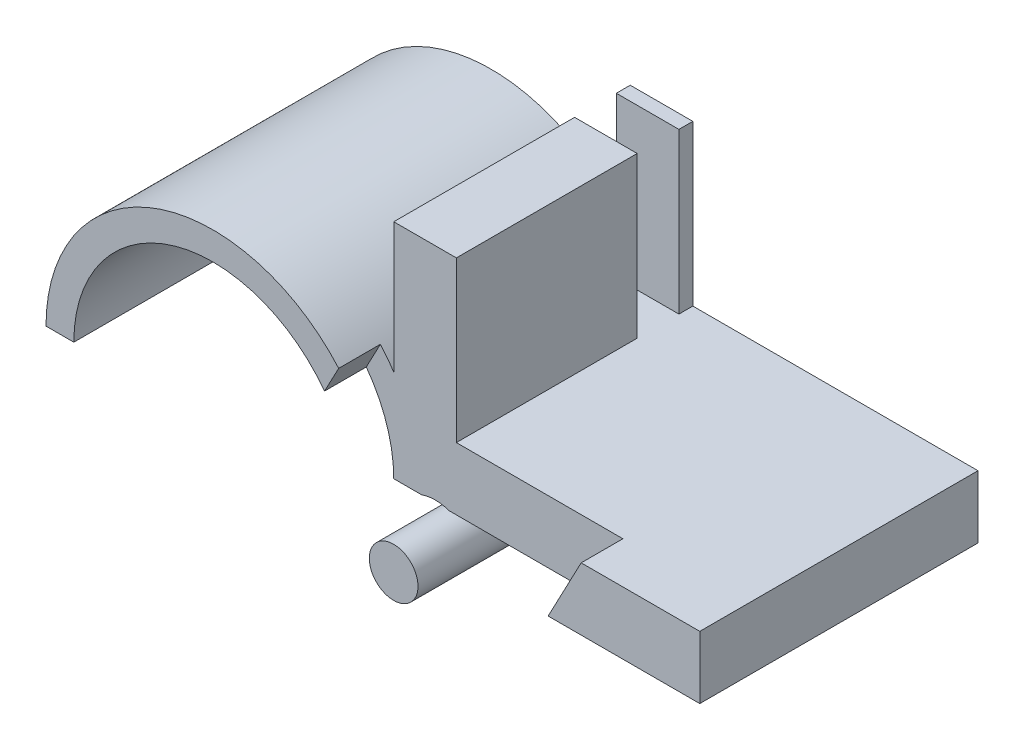
ISO-10303-21;
HEADER;
FILE_DESCRIPTION(('STEP AP214'),'2;1');
FILE_NAME('part.step','',(''),(''),'','','');
FILE_SCHEMA(('AUTOMOTIVE_DESIGN { 1 0 10303 214 1 1 1 1 }'));
ENDSEC;
DATA;
#1=APPLICATION_CONTEXT('core data for automotive mechanical design processes');
#2=APPLICATION_PROTOCOL_DEFINITION('international standard','automotive_design',2000,#1);
#3=PRODUCT_CONTEXT('',#1,'mechanical');
#4=PRODUCT('Part','Part','',(#3));
#5=PRODUCT_RELATED_PRODUCT_CATEGORY('part','',(#4));
#6=PRODUCT_DEFINITION_FORMATION('','',#4);
#7=PRODUCT_DEFINITION_CONTEXT('part definition',#1,'design');
#8=PRODUCT_DEFINITION('design','',#6,#7);
#9=PRODUCT_DEFINITION_SHAPE('','',#8);
#10=(LENGTH_UNIT() NAMED_UNIT(*) SI_UNIT(.MILLI.,.METRE.));
#11=(NAMED_UNIT(*) PLANE_ANGLE_UNIT() SI_UNIT($,.RADIAN.));
#12=(NAMED_UNIT(*) SI_UNIT($,.STERADIAN.) SOLID_ANGLE_UNIT());
#13=UNCERTAINTY_MEASURE_WITH_UNIT(LENGTH_MEASURE(1.E-05),#10,'distance_accuracy_value','');
#14=(GEOMETRIC_REPRESENTATION_CONTEXT(3) GLOBAL_UNCERTAINTY_ASSIGNED_CONTEXT((#13)) GLOBAL_UNIT_ASSIGNED_CONTEXT((#10,
#11,#12)) REPRESENTATION_CONTEXT('',''));
#15=CARTESIAN_POINT('',(0.,0.,0.));
#16=DIRECTION('',(0.,0.,1.));
#17=DIRECTION('',(1.,0.,0.));
#18=AXIS2_PLACEMENT_3D('',#15,#16,#17);
#19=CARTESIAN_POINT('',(10.,16.,20.));
#20=DIRECTION('',(-1.,0.,0.));
#21=DIRECTION('',(0.,0.,1.));
#22=AXIS2_PLACEMENT_3D('',#19,#20,#21);
#23=PLANE('',#22);
#24=DIRECTION('',(0.,1.,0.));
#25=VECTOR('',#24,1.);
#26=CARTESIAN_POINT('',(10.,16.,4.));
#27=LINE('',#26,#25);
#28=CARTESIAN_POINT('',(10.,6.63324958071081,4.));
#29=VERTEX_POINT('',#28);
#30=CARTESIAN_POINT('',(10.,16.,4.));
#31=VERTEX_POINT('',#30);
#32=EDGE_CURVE('E257',#29,#31,#27,.T.);
#33=ORIENTED_EDGE('',*,*,#32,.F.);
#34=DIRECTION('',(0.,0.,-1.));
#35=VECTOR('',#34,1.);
#36=CARTESIAN_POINT('',(10.,6.63324958071081,20.));
#37=LINE('',#36,#35);
#38=CARTESIAN_POINT('',(10.,6.63324958071081,17.));
#39=VERTEX_POINT('',#38);
#40=EDGE_CURVE('E320',#29,#39,#37,.F.);
#41=ORIENTED_EDGE('',*,*,#40,.T.);
#42=DIRECTION('',(0.,1.,0.));
#43=VECTOR('',#42,1.);
#44=CARTESIAN_POINT('',(10.,16.,17.));
#45=LINE('',#44,#43);
#46=CARTESIAN_POINT('',(10.,16.,17.));
#47=VERTEX_POINT('',#46);
#48=EDGE_CURVE('E286',#39,#47,#45,.T.);
#49=ORIENTED_EDGE('',*,*,#48,.T.);
#50=DIRECTION('',(0.,0.,-1.));
#51=VECTOR('',#50,1.);
#52=CARTESIAN_POINT('',(10.,16.,20.));
#53=LINE('',#52,#51);
#54=EDGE_CURVE('E306',#47,#31,#53,.T.);
#55=ORIENTED_EDGE('',*,*,#54,.T.);
#56=EDGE_LOOP('',(#33,#41,#49,#55));
#57=FACE_BOUND('',#56,.T.);
#58=ADVANCED_FACE('F65',(#57),#23,.T.);
#59=CARTESIAN_POINT('',(0.,16.,0.));
#60=DIRECTION('',(0.,-1.,0.));
#61=DIRECTION('',(0.,0.,-1.));
#62=AXIS2_PLACEMENT_3D('',#59,#60,#61);
#63=PLANE('',#62);
#64=DIRECTION('',(0.,0.,1.));
#65=VECTOR('',#64,1.);
#66=CARTESIAN_POINT('',(14.5,16.,20.));
#67=LINE('',#66,#65);
#68=CARTESIAN_POINT('',(14.5,16.,4.));
#69=VERTEX_POINT('',#68);
#70=CARTESIAN_POINT('',(14.5,16.,17.));
#71=VERTEX_POINT('',#70);
#72=EDGE_CURVE('E312',#69,#71,#67,.T.);
#73=ORIENTED_EDGE('',*,*,#72,.F.);
#74=DIRECTION('',(1.,0.,0.));
#75=VECTOR('',#74,1.);
#76=CARTESIAN_POINT('',(9.5,16.,4.));
#77=LINE('',#76,#75);
#78=EDGE_CURVE('E245',#31,#69,#77,.T.);
#79=ORIENTED_EDGE('',*,*,#78,.F.);
#80=ORIENTED_EDGE('',*,*,#54,.F.);
#81=DIRECTION('',(-1.,0.,0.));
#82=VECTOR('',#81,1.);
#83=CARTESIAN_POINT('',(0.,16.,17.));
#84=LINE('',#83,#82);
#85=EDGE_CURVE('E396',#71,#47,#84,.T.);
#86=ORIENTED_EDGE('',*,*,#85,.F.);
#87=EDGE_LOOP('',(#73,#79,#80,#86));
#88=FACE_BOUND('',#87,.T.);
#89=ADVANCED_FACE('F425',(#88),#63,.F.);
#90=CARTESIAN_POINT('',(14.5,16.,20.));
#91=DIRECTION('',(1.,0.,0.));
#92=DIRECTION('',(0.,0.,-1.));
#93=AXIS2_PLACEMENT_3D('',#90,#91,#92);
#94=PLANE('',#93);
#95=DIRECTION('',(0.,-1.,0.));
#96=VECTOR('',#95,1.);
#97=CARTESIAN_POINT('',(14.5,16.,4.));
#98=LINE('',#97,#96);
#99=CARTESIAN_POINT('',(14.5,4.5,4.));
#100=VERTEX_POINT('',#99);
#101=EDGE_CURVE('E80',#69,#100,#98,.T.);
#102=ORIENTED_EDGE('',*,*,#101,.F.);
#103=ORIENTED_EDGE('',*,*,#72,.T.);
#104=DIRECTION('',(0.,-1.,0.));
#105=VECTOR('',#104,1.);
#106=CARTESIAN_POINT('',(14.5,16.,17.));
#107=LINE('',#106,#105);
#108=CARTESIAN_POINT('',(14.5,4.5,17.));
#109=VERTEX_POINT('',#108);
#110=EDGE_CURVE('E273',#71,#109,#107,.T.);
#111=ORIENTED_EDGE('',*,*,#110,.T.);
#112=DIRECTION('',(0.,0.,1.));
#113=VECTOR('',#112,1.);
#114=CARTESIAN_POINT('',(14.5,4.5,0.));
#115=LINE('',#114,#113);
#116=EDGE_CURVE('E393',#100,#109,#115,.T.);
#117=ORIENTED_EDGE('',*,*,#116,.F.);
#118=EDGE_LOOP('',(#102,#103,#111,#117));
#119=FACE_BOUND('',#118,.T.);
#120=ADVANCED_FACE('F487',(#119),#94,.T.);
#121=DIRECTION('',(0.,-1.,0.));
#122=VECTOR('',#121,1.);
#123=CARTESIAN_POINT('',(10.,16.,1.));
#124=LINE('',#123,#122);
#125=CARTESIAN_POINT('',(10.,16.,1.));
#126=VERTEX_POINT('',#125);
#127=CARTESIAN_POINT('',(10.,6.63324958071081,1.));
#128=VERTEX_POINT('',#127);
#129=EDGE_CURVE('E253',#126,#128,#124,.T.);
#130=ORIENTED_EDGE('',*,*,#129,.F.);
#131=CARTESIAN_POINT('',(10.,16.,0.));
#132=VERTEX_POINT('',#131);
#133=EDGE_CURVE('E305',#126,#132,#53,.T.);
#134=ORIENTED_EDGE('',*,*,#133,.T.);
#135=DIRECTION('',(0.,-1.,0.));
#136=VECTOR('',#135,1.);
#137=CARTESIAN_POINT('',(10.,16.,0.));
#138=LINE('',#137,#136);
#139=CARTESIAN_POINT('',(10.,6.63324958071081,0.));
#140=VERTEX_POINT('',#139);
#141=EDGE_CURVE('E316',#132,#140,#138,.T.);
#142=ORIENTED_EDGE('',*,*,#141,.T.);
#143=EDGE_CURVE('E323',#140,#128,#37,.F.);
#144=ORIENTED_EDGE('',*,*,#143,.T.);
#145=EDGE_LOOP('',(#130,#134,#142,#144));
#146=FACE_BOUND('',#145,.T.);
#147=ADVANCED_FACE('F482',(#146),#23,.T.);
#148=ORIENTED_EDGE('',*,*,#133,.F.);
#149=DIRECTION('',(1.,0.,0.));
#150=VECTOR('',#149,1.);
#151=CARTESIAN_POINT('',(9.5,16.,1.));
#152=LINE('',#151,#150);
#153=CARTESIAN_POINT('',(14.5,16.,1.));
#154=VERTEX_POINT('',#153);
#155=EDGE_CURVE('E248',#126,#154,#152,.T.);
#156=ORIENTED_EDGE('',*,*,#155,.T.);
#157=CARTESIAN_POINT('',(14.5,16.,0.));
#158=VERTEX_POINT('',#157);
#159=EDGE_CURVE('E313',#158,#154,#67,.T.);
#160=ORIENTED_EDGE('',*,*,#159,.F.);
#161=DIRECTION('',(1.,0.,0.));
#162=VECTOR('',#161,1.);
#163=CARTESIAN_POINT('',(10.,16.,0.));
#164=LINE('',#163,#162);
#165=EDGE_CURVE('E309',#132,#158,#164,.T.);
#166=ORIENTED_EDGE('',*,*,#165,.F.);
#167=EDGE_LOOP('',(#148,#156,#160,#166));
#168=FACE_BOUND('',#167,.T.);
#169=ADVANCED_FACE('F489',(#168),#63,.F.);
#170=CARTESIAN_POINT('',(0.,0.,20.));
#171=DIRECTION('',(0.,-1.,0.));
#172=DIRECTION('',(0.,0.,-1.));
#173=AXIS2_PLACEMENT_3D('',#170,#171,#172);
#174=PLANE('',#173);
#175=DIRECTION('',(1.,0.,0.));
#176=VECTOR('',#175,1.);
#177=CARTESIAN_POINT('',(0.,0.,5.));
#178=LINE('',#177,#176);
#179=CARTESIAN_POINT('',(10.,0.,5.));
#180=VERTEX_POINT('',#179);
#181=CARTESIAN_POINT('',(12.,0.,5.));
#182=VERTEX_POINT('',#181);
#183=EDGE_CURVE('E390',#180,#182,#178,.T.);
#184=ORIENTED_EDGE('',*,*,#183,.T.);
#185=DIRECTION('',(0.,0.,-1.));
#186=VECTOR('',#185,1.);
#187=CARTESIAN_POINT('',(12.,0.,21.));
#188=LINE('',#187,#186);
#189=CARTESIAN_POINT('',(12.,0.,17.));
#190=VERTEX_POINT('',#189);
#191=EDGE_CURVE('E263',#182,#190,#188,.F.);
#192=ORIENTED_EDGE('',*,*,#191,.T.);
#193=DIRECTION('',(-1.,0.,0.));
#194=VECTOR('',#193,1.);
#195=CARTESIAN_POINT('',(0.,0.,17.));
#196=LINE('',#195,#194);
#197=CARTESIAN_POINT('',(10.,0.,17.));
#198=VERTEX_POINT('',#197);
#199=EDGE_CURVE('E291',#190,#198,#196,.T.);
#200=ORIENTED_EDGE('',*,*,#199,.T.);
#201=DIRECTION('',(0.,0.,-1.));
#202=VECTOR('',#201,1.);
#203=CARTESIAN_POINT('',(10.,0.,20.));
#204=LINE('',#203,#202);
#205=EDGE_CURVE('E375',#198,#180,#204,.T.);
#206=ORIENTED_EDGE('',*,*,#205,.T.);
#207=EDGE_LOOP('',(#184,#192,#200,#206));
#208=FACE_BOUND('',#207,.T.);
#209=ADVANCED_FACE('F465',(#208),#174,.T.);
#210=CARTESIAN_POINT('',(24.0972933297532,0.,17.));
#211=VERTEX_POINT('',#210);
#212=CARTESIAN_POINT('',(13.9835123127202,0.,17.));
#213=VERTEX_POINT('',#212);
#214=EDGE_CURVE('E292',#211,#213,#196,.T.);
#215=ORIENTED_EDGE('',*,*,#214,.T.);
#216=DIRECTION('',(0.,0.,-1.));
#217=VECTOR('',#216,1.);
#218=CARTESIAN_POINT('',(13.9835123127202,0.,21.));
#219=LINE('',#218,#217);
#220=CARTESIAN_POINT('',(13.9835123127202,0.,5.));
#221=VERTEX_POINT('',#220);
#222=EDGE_CURVE('E88',#213,#221,#219,.T.);
#223=ORIENTED_EDGE('',*,*,#222,.T.);
#224=DIRECTION('',(0.,0.,-1.));
#225=VECTOR('',#224,1.);
#226=CARTESIAN_POINT('',(13.9835123127202,0.,5.));
#227=LINE('',#226,#225);
#228=CARTESIAN_POINT('',(13.9835123127202,0.,0.));
#229=VERTEX_POINT('',#228);
#230=EDGE_CURVE('E344',#229,#221,#227,.F.);
#231=ORIENTED_EDGE('',*,*,#230,.F.);
#232=DIRECTION('',(-1.,0.,0.));
#233=VECTOR('',#232,1.);
#234=CARTESIAN_POINT('',(0.,0.,0.));
#235=LINE('',#234,#233);
#236=CARTESIAN_POINT('',(35.,0.,0.));
#237=VERTEX_POINT('',#236);
#238=EDGE_CURVE('E367',#237,#229,#235,.T.);
#239=ORIENTED_EDGE('',*,*,#238,.F.);
#240=DIRECTION('',(0.,0.,-1.));
#241=VECTOR('',#240,1.);
#242=CARTESIAN_POINT('',(35.,0.,20.));
#243=LINE('',#242,#241);
#244=CARTESIAN_POINT('',(35.,0.,20.));
#245=VERTEX_POINT('',#244);
#246=EDGE_CURVE('E347',#245,#237,#243,.T.);
#247=ORIENTED_EDGE('',*,*,#246,.F.);
#248=DIRECTION('',(-1.,0.,0.));
#249=VECTOR('',#248,1.);
#250=CARTESIAN_POINT('',(0.,0.,20.));
#251=LINE('',#250,#249);
#252=CARTESIAN_POINT('',(24.0972933297532,0.,20.));
#253=VERTEX_POINT('',#252);
#254=EDGE_CURVE('E372',#245,#253,#251,.T.);
#255=ORIENTED_EDGE('',*,*,#254,.T.);
#256=DIRECTION('',(0.,0.,-1.));
#257=VECTOR('',#256,1.);
#258=CARTESIAN_POINT('',(24.0972933297532,0.,20.));
#259=LINE('',#258,#257);
#260=EDGE_CURVE('E302',#253,#211,#259,.T.);
#261=ORIENTED_EDGE('',*,*,#260,.T.);
#262=EDGE_LOOP('',(#215,#223,#231,#239,#247,#255,#261));
#263=FACE_BOUND('',#262,.T.);
#264=ADVANCED_FACE('F406',(#263),#174,.T.);
#265=CARTESIAN_POINT('',(0.,0.,20.));
#266=DIRECTION('',(0.,0.,-1.));
#267=DIRECTION('',(-1.,0.,0.));
#268=AXIS2_PLACEMENT_3D('',#265,#266,#267);
#269=CYLINDRICAL_SURFACE('',#268,12.);
#270=CARTESIAN_POINT('',(0.,0.,4.));
#271=DIRECTION('',(0.,0.,1.));
#272=DIRECTION('',(0.,-1.,0.));
#273=AXIS2_PLACEMENT_3D('',#270,#271,#272);
#274=CIRCLE('',#273,12.);
#275=CARTESIAN_POINT('',(9.5,7.3314391493076,4.));
#276=VERTEX_POINT('',#275);
#277=EDGE_CURVE('E255',#276,#29,#274,.F.);
#278=ORIENTED_EDGE('',*,*,#277,.F.);
#279=DIRECTION('',(0.,0.,-1.));
#280=VECTOR('',#279,1.);
#281=CARTESIAN_POINT('',(9.5,7.3314391493076,20.));
#282=LINE('',#281,#280);
#283=CARTESIAN_POINT('',(9.5,7.3314391493076,1.));
#284=VERTEX_POINT('',#283);
#285=EDGE_CURVE('E12',#276,#284,#282,.T.);
#286=ORIENTED_EDGE('',*,*,#285,.T.);
#287=CARTESIAN_POINT('',(0.,0.,1.));
#288=DIRECTION('',(0.,0.,-1.));
#289=DIRECTION('',(0.,1.,0.));
#290=AXIS2_PLACEMENT_3D('',#287,#288,#289);
#291=CIRCLE('',#290,12.);
#292=EDGE_CURVE('E247',#128,#284,#291,.F.);
#293=ORIENTED_EDGE('',*,*,#292,.F.);
#294=ORIENTED_EDGE('',*,*,#143,.F.);
#295=CARTESIAN_POINT('',(0.,0.,0.));
#296=DIRECTION('',(0.,0.,1.));
#297=DIRECTION('',(1.,0.,0.));
#298=AXIS2_PLACEMENT_3D('',#295,#296,#297);
#299=CIRCLE('',#298,12.);
#300=CARTESIAN_POINT('',(-12.,0.,0.));
#301=VERTEX_POINT('',#300);
#302=EDGE_CURVE('E362',#301,#140,#299,.F.);
#303=ORIENTED_EDGE('',*,*,#302,.F.);
#304=DIRECTION('',(0.,0.,-1.));
#305=VECTOR('',#304,1.);
#306=CARTESIAN_POINT('',(-12.,0.,20.));
#307=LINE('',#306,#305);
#308=CARTESIAN_POINT('',(-12.,0.,20.));
#309=VERTEX_POINT('',#308);
#310=EDGE_CURVE('E388',#309,#301,#307,.T.);
#311=ORIENTED_EDGE('',*,*,#310,.F.);
#312=CARTESIAN_POINT('',(0.,0.,20.));
#313=DIRECTION('',(0.,0.,1.));
#314=DIRECTION('',(1.,0.,0.));
#315=AXIS2_PLACEMENT_3D('',#312,#313,#314);
#316=CIRCLE('',#315,12.);
#317=CARTESIAN_POINT('',(9.03996044176764,7.89171180487962,20.));
#318=VERTEX_POINT('',#317);
#319=EDGE_CURVE('E363',#309,#318,#316,.F.);
#320=ORIENTED_EDGE('',*,*,#319,.T.);
#321=DIRECTION('',(0.,0.,-1.));
#322=VECTOR('',#321,1.);
#323=CARTESIAN_POINT('',(9.03996044176764,7.89171180487962,20.));
#324=LINE('',#323,#322);
#325=CARTESIAN_POINT('',(9.03996044176764,7.89171180487962,17.));
#326=VERTEX_POINT('',#325);
#327=EDGE_CURVE('E300',#326,#318,#324,.F.);
#328=ORIENTED_EDGE('',*,*,#327,.F.);
#329=CARTESIAN_POINT('',(0.,0.,17.));
#330=DIRECTION('',(0.,0.,1.));
#331=DIRECTION('',(1.,0.,0.));
#332=AXIS2_PLACEMENT_3D('',#329,#330,#331);
#333=CIRCLE('',#332,12.);
#334=EDGE_CURVE('E288',#326,#39,#333,.F.);
#335=ORIENTED_EDGE('',*,*,#334,.T.);
#336=ORIENTED_EDGE('',*,*,#40,.F.);
#337=EDGE_LOOP('',(#278,#286,#293,#294,#303,#311,#320,#328,#335,#336));
#338=FACE_BOUND('',#337,.T.);
#339=ADVANCED_FACE('F67',(#338),#269,.T.);
#340=CARTESIAN_POINT('',(0.,0.,20.));
#341=DIRECTION('',(0.,0.,-1.));
#342=DIRECTION('',(-1.,0.,0.));
#343=AXIS2_PLACEMENT_3D('',#340,#341,#342);
#344=CYLINDRICAL_SURFACE('',#343,10.);
#345=ORIENTED_EDGE('',*,*,#205,.F.);
#346=CARTESIAN_POINT('',(0.,0.,17.));
#347=DIRECTION('',(0.,0.,1.));
#348=DIRECTION('',(1.,0.,0.));
#349=AXIS2_PLACEMENT_3D('',#346,#347,#348);
#350=CIRCLE('',#349,10.);
#351=CARTESIAN_POINT('',(8.02434549027254,5.96740139866112,17.));
#352=VERTEX_POINT('',#351);
#353=EDGE_CURVE('E295',#198,#352,#350,.T.);
#354=ORIENTED_EDGE('',*,*,#353,.T.);
#355=DIRECTION('',(0.,0.,-1.));
#356=VECTOR('',#355,1.);
#357=CARTESIAN_POINT('',(8.02434549027254,5.96740139866112,20.));
#358=LINE('',#357,#356);
#359=CARTESIAN_POINT('',(8.02434549027254,5.96740139866112,20.));
#360=VERTEX_POINT('',#359);
#361=EDGE_CURVE('E298',#360,#352,#358,.T.);
#362=ORIENTED_EDGE('',*,*,#361,.F.);
#363=CARTESIAN_POINT('',(0.,0.,20.));
#364=DIRECTION('',(0.,0.,1.));
#365=DIRECTION('',(1.,0.,0.));
#366=AXIS2_PLACEMENT_3D('',#363,#364,#365);
#367=CIRCLE('',#366,10.);
#368=CARTESIAN_POINT('',(-10.,0.,20.));
#369=VERTEX_POINT('',#368);
#370=EDGE_CURVE('E370',#360,#369,#367,.T.);
#371=ORIENTED_EDGE('',*,*,#370,.T.);
#372=DIRECTION('',(0.,0.,-1.));
#373=VECTOR('',#372,1.);
#374=CARTESIAN_POINT('',(-10.,0.,20.));
#375=LINE('',#374,#373);
#376=CARTESIAN_POINT('',(-10.,0.,0.));
#377=VERTEX_POINT('',#376);
#378=EDGE_CURVE('E386',#369,#377,#375,.T.);
#379=ORIENTED_EDGE('',*,*,#378,.T.);
#380=CARTESIAN_POINT('',(0.,0.,0.));
#381=DIRECTION('',(0.,0.,1.));
#382=DIRECTION('',(1.,0.,0.));
#383=AXIS2_PLACEMENT_3D('',#380,#381,#382);
#384=CIRCLE('',#383,10.);
#385=CARTESIAN_POINT('',(10.,0.,0.));
#386=VERTEX_POINT('',#385);
#387=EDGE_CURVE('E381',#386,#377,#384,.T.);
#388=ORIENTED_EDGE('',*,*,#387,.F.);
#389=DIRECTION('',(0.,0.,-1.));
#390=VECTOR('',#389,1.);
#391=CARTESIAN_POINT('',(10.,0.,5.));
#392=LINE('',#391,#390);
#393=EDGE_CURVE('E336',#180,#386,#392,.T.);
#394=ORIENTED_EDGE('',*,*,#393,.F.);
#395=EDGE_LOOP('',(#345,#354,#362,#371,#379,#388,#394));
#396=FACE_BOUND('',#395,.T.);
#397=ADVANCED_FACE('F445',(#396),#344,.F.);
#398=CARTESIAN_POINT('',(0.,0.,20.));
#399=DIRECTION('',(0.,0.,1.));
#400=DIRECTION('',(1.,0.,0.));
#401=AXIS2_PLACEMENT_3D('',#398,#399,#400);
#402=PLANE('',#401);
#403=DIRECTION('',(1.,0.,0.));
#404=VECTOR('',#403,1.);
#405=CARTESIAN_POINT('',(10.,4.5,20.));
#406=LINE('',#405,#404);
#407=CARTESIAN_POINT('',(26.4723089545499,4.5,20.));
#408=VERTEX_POINT('',#407);
#409=CARTESIAN_POINT('',(35.,4.5,20.));
#410=VERTEX_POINT('',#409);
#411=EDGE_CURVE('E348',#408,#410,#406,.T.);
#412=ORIENTED_EDGE('',*,*,#411,.F.);
#413=DIRECTION('',(-0.466761021290812,-0.884383485261658,0.));
#414=VECTOR('',#413,1.);
#415=CARTESIAN_POINT('',(18.8473160117556,-9.94726000297817,20.));
#416=LINE('',#415,#414);
#417=EDGE_CURVE('E274',#408,#253,#416,.T.);
#418=ORIENTED_EDGE('',*,*,#417,.T.);
#419=ORIENTED_EDGE('',*,*,#254,.F.);
#420=DIRECTION('',(0.,-1.,0.));
#421=VECTOR('',#420,1.);
#422=CARTESIAN_POINT('',(35.,4.5,20.));
#423=LINE('',#422,#421);
#424=EDGE_CURVE('E359',#410,#245,#423,.T.);
#425=ORIENTED_EDGE('',*,*,#424,.F.);
#426=EDGE_LOOP('',(#412,#418,#419,#425));
#427=FACE_BOUND('',#426,.T.);
#428=ADVANCED_FACE('F413',(#427),#402,.T.);
#429=CARTESIAN_POINT('',(0.,4.5,0.));
#430=DIRECTION('',(0.,-1.,0.));
#431=DIRECTION('',(0.,0.,-1.));
#432=AXIS2_PLACEMENT_3D('',#429,#430,#431);
#433=PLANE('',#432);
#434=DIRECTION('',(0.,0.,-1.));
#435=VECTOR('',#434,1.);
#436=CARTESIAN_POINT('',(26.4723089545499,4.5,0.));
#437=LINE('',#436,#435);
#438=CARTESIAN_POINT('',(26.4723089545499,4.5,17.));
#439=VERTEX_POINT('',#438);
#440=EDGE_CURVE('E399',#408,#439,#437,.T.);
#441=ORIENTED_EDGE('',*,*,#440,.F.);
#442=ORIENTED_EDGE('',*,*,#411,.T.);
#443=DIRECTION('',(0.,0.,-1.));
#444=VECTOR('',#443,1.);
#445=CARTESIAN_POINT('',(35.,4.5,20.));
#446=LINE('',#445,#444);
#447=CARTESIAN_POINT('',(35.,4.5,0.));
#448=VERTEX_POINT('',#447);
#449=EDGE_CURVE('E350',#410,#448,#446,.T.);
#450=ORIENTED_EDGE('',*,*,#449,.T.);
#451=DIRECTION('',(-1.,0.,0.));
#452=VECTOR('',#451,1.);
#453=CARTESIAN_POINT('',(10.,4.5,0.));
#454=LINE('',#453,#452);
#455=CARTESIAN_POINT('',(14.5,4.5,0.));
#456=VERTEX_POINT('',#455);
#457=EDGE_CURVE('E352',#448,#456,#454,.T.);
#458=ORIENTED_EDGE('',*,*,#457,.T.);
#459=CARTESIAN_POINT('',(14.5,4.5,1.));
#460=VERTEX_POINT('',#459);
#461=EDGE_CURVE('E394',#456,#460,#115,.T.);
#462=ORIENTED_EDGE('',*,*,#461,.T.);
#463=DIRECTION('',(1.,0.,0.));
#464=VECTOR('',#463,1.);
#465=CARTESIAN_POINT('',(9.5,4.5,1.));
#466=LINE('',#465,#464);
#467=CARTESIAN_POINT('',(9.5,4.5,1.));
#468=VERTEX_POINT('',#467);
#469=EDGE_CURVE('E233',#468,#460,#466,.T.);
#470=ORIENTED_EDGE('',*,*,#469,.F.);
#471=DIRECTION('',(0.,0.,-1.));
#472=VECTOR('',#471,1.);
#473=CARTESIAN_POINT('',(9.5,4.5,4.));
#474=LINE('',#473,#472);
#475=CARTESIAN_POINT('',(9.5,4.5,4.));
#476=VERTEX_POINT('',#475);
#477=EDGE_CURVE('E225',#476,#468,#474,.T.);
#478=ORIENTED_EDGE('',*,*,#477,.F.);
#479=DIRECTION('',(1.,0.,0.));
#480=VECTOR('',#479,1.);
#481=CARTESIAN_POINT('',(9.5,4.5,4.));
#482=LINE('',#481,#480);
#483=EDGE_CURVE('E229',#476,#100,#482,.T.);
#484=ORIENTED_EDGE('',*,*,#483,.T.);
#485=ORIENTED_EDGE('',*,*,#116,.T.);
#486=DIRECTION('',(-1.,0.,0.));
#487=VECTOR('',#486,1.);
#488=CARTESIAN_POINT('',(0.,4.5,17.));
#489=LINE('',#488,#487);
#490=EDGE_CURVE('E283',#439,#109,#489,.T.);
#491=ORIENTED_EDGE('',*,*,#490,.F.);
#492=EDGE_LOOP('',(#441,#442,#450,#458,#462,#470,#478,#484,#485,#491));
#493=FACE_BOUND('',#492,.T.);
#494=ADVANCED_FACE('F237',(#493),#433,.F.);
#495=CARTESIAN_POINT('',(12.9917561563601,-2.83132826184494,20.));
#496=DIRECTION('',(0.,0.,-1.));
#497=DIRECTION('',(-1.,0.,0.));
#498=AXIS2_PLACEMENT_3D('',#495,#496,#497);
#499=CYLINDRICAL_SURFACE('',#498,1.75);
#500=CARTESIAN_POINT('',(12.9917561563601,-2.83132826184494,5.));
#501=DIRECTION('',(0.,0.,-1.));
#502=DIRECTION('',(-1.,0.,0.));
#503=AXIS2_PLACEMENT_3D('',#500,#501,#502);
#504=CIRCLE('',#503,1.75);
#505=CARTESIAN_POINT('',(11.2417561563601,-2.83132826184494,5.));
#506=VERTEX_POINT('',#505);
#507=EDGE_CURVE('E339',#506,#506,#504,.F.);
#508=ORIENTED_EDGE('',*,*,#507,.T.);
#509=EDGE_LOOP('',(#508));
#510=FACE_BOUND('',#509,.T.);
#511=CARTESIAN_POINT('',(12.9917561563601,-2.83132826184494,20.));
#512=DIRECTION('',(0.,0.,1.));
#513=DIRECTION('',(1.,0.,0.));
#514=AXIS2_PLACEMENT_3D('',#511,#512,#513);
#515=CIRCLE('',#514,1.75);
#516=CARTESIAN_POINT('',(14.7417561563601,-2.83132826184494,20.));
#517=VERTEX_POINT('',#516);
#518=EDGE_CURVE('E266',#517,#517,#515,.T.);
#519=ORIENTED_EDGE('',*,*,#518,.F.);
#520=EDGE_LOOP('',(#519));
#521=FACE_BOUND('',#520,.T.);
#522=ADVANCED_FACE('F525',(#510,#521),#499,.T.);
#523=DIRECTION('',(0.,1.,0.));
#524=VECTOR('',#523,1.);
#525=CARTESIAN_POINT('',(14.5,16.,1.));
#526=LINE('',#525,#524);
#527=EDGE_CURVE('E227',#460,#154,#526,.T.);
#528=ORIENTED_EDGE('',*,*,#527,.F.);
#529=ORIENTED_EDGE('',*,*,#461,.F.);
#530=DIRECTION('',(0.,-1.,0.));
#531=VECTOR('',#530,1.);
#532=CARTESIAN_POINT('',(14.5,16.,0.));
#533=LINE('',#532,#531);
#534=EDGE_CURVE('E317',#158,#456,#533,.T.);
#535=ORIENTED_EDGE('',*,*,#534,.F.);
#536=ORIENTED_EDGE('',*,*,#159,.T.);
#537=EDGE_LOOP('',(#528,#529,#535,#536));
#538=FACE_BOUND('',#537,.T.);
#539=ADVANCED_FACE('F499',(#538),#94,.T.);
#540=CARTESIAN_POINT('',(0.,0.,20.));
#541=DIRECTION('',(0.,-1.,0.));
#542=DIRECTION('',(0.,0.,-1.));
#543=AXIS2_PLACEMENT_3D('',#540,#541,#542);
#544=PLANE('',#543);
#545=DIRECTION('',(-1.,0.,0.));
#546=VECTOR('',#545,1.);
#547=CARTESIAN_POINT('',(0.,0.,0.));
#548=LINE('',#547,#546);
#549=EDGE_CURVE('E378',#377,#301,#548,.T.);
#550=ORIENTED_EDGE('',*,*,#549,.F.);
#551=ORIENTED_EDGE('',*,*,#378,.F.);
#552=DIRECTION('',(-1.,0.,0.));
#553=VECTOR('',#552,1.);
#554=CARTESIAN_POINT('',(0.,0.,20.));
#555=LINE('',#554,#553);
#556=EDGE_CURVE('E366',#369,#309,#555,.T.);
#557=ORIENTED_EDGE('',*,*,#556,.T.);
#558=ORIENTED_EDGE('',*,*,#310,.T.);
#559=EDGE_LOOP('',(#550,#551,#557,#558));
#560=FACE_BOUND('',#559,.T.);
#561=ADVANCED_FACE('F449',(#560),#544,.T.);
#562=DIRECTION('',(-0.466761021290812,-0.884383485261658,0.));
#563=VECTOR('',#562,1.);
#564=CARTESIAN_POINT('',(11.9827403752759,13.4674686809719,20.));
#565=LINE('',#564,#563);
#566=EDGE_CURVE('E269',#318,#360,#565,.T.);
#567=ORIENTED_EDGE('',*,*,#566,.F.);
#568=ORIENTED_EDGE('',*,*,#319,.F.);
#569=ORIENTED_EDGE('',*,*,#556,.F.);
#570=ORIENTED_EDGE('',*,*,#370,.F.);
#571=EDGE_LOOP('',(#567,#568,#569,#570));
#572=FACE_BOUND('',#571,.T.);
#573=ADVANCED_FACE('F440',(#572),#402,.T.);
#574=CARTESIAN_POINT('',(0.,0.,0.));
#575=DIRECTION('',(0.,0.,1.));
#576=DIRECTION('',(1.,0.,0.));
#577=AXIS2_PLACEMENT_3D('',#574,#575,#576);
#578=PLANE('',#577);
#579=ORIENTED_EDGE('',*,*,#302,.T.);
#580=ORIENTED_EDGE('',*,*,#141,.F.);
#581=ORIENTED_EDGE('',*,*,#165,.T.);
#582=ORIENTED_EDGE('',*,*,#534,.T.);
#583=ORIENTED_EDGE('',*,*,#457,.F.);
#584=DIRECTION('',(0.,-1.,0.));
#585=VECTOR('',#584,1.);
#586=CARTESIAN_POINT('',(35.,4.5,0.));
#587=LINE('',#586,#585);
#588=EDGE_CURVE('E354',#448,#237,#587,.T.);
#589=ORIENTED_EDGE('',*,*,#588,.T.);
#590=ORIENTED_EDGE('',*,*,#238,.T.);
#591=CARTESIAN_POINT('',(12.9917561563601,-2.83132826184494,0.));
#592=DIRECTION('',(0.,0.,-1.));
#593=DIRECTION('',(-1.,0.,0.));
#594=AXIS2_PLACEMENT_3D('',#591,#592,#593);
#595=CIRCLE('',#594,3.);
#596=CARTESIAN_POINT('',(10.,-2.60907817549732,0.));
#597=VERTEX_POINT('',#596);
#598=EDGE_CURVE('E326',#229,#597,#595,.T.);
#599=ORIENTED_EDGE('',*,*,#598,.T.);
#600=DIRECTION('',(0.,1.,0.));
#601=VECTOR('',#600,1.);
#602=CARTESIAN_POINT('',(10.,0.,0.));
#603=LINE('',#602,#601);
#604=EDGE_CURVE('E330',#597,#386,#603,.T.);
#605=ORIENTED_EDGE('',*,*,#604,.T.);
#606=ORIENTED_EDGE('',*,*,#387,.T.);
#607=ORIENTED_EDGE('',*,*,#549,.T.);
#608=EDGE_LOOP('',(#579,#580,#581,#582,#583,#589,#590,#599,#605,#606,#607));
#609=FACE_BOUND('',#608,.T.);
#610=ADVANCED_FACE('F452',(#609),#578,.F.);
#611=CARTESIAN_POINT('',(35.,4.5,20.));
#612=DIRECTION('',(-1.,0.,0.));
#613=DIRECTION('',(0.,0.,1.));
#614=AXIS2_PLACEMENT_3D('',#611,#612,#613);
#615=PLANE('',#614);
#616=ORIENTED_EDGE('',*,*,#246,.T.);
#617=ORIENTED_EDGE('',*,*,#588,.F.);
#618=ORIENTED_EDGE('',*,*,#449,.F.);
#619=ORIENTED_EDGE('',*,*,#424,.T.);
#620=EDGE_LOOP('',(#616,#617,#618,#619));
#621=FACE_BOUND('',#620,.T.);
#622=ADVANCED_FACE('F513',(#621),#615,.F.);
#623=CARTESIAN_POINT('',(10.,0.,5.));
#624=DIRECTION('',(-1.,0.,0.));
#625=DIRECTION('',(0.,0.,1.));
#626=AXIS2_PLACEMENT_3D('',#623,#624,#625);
#627=PLANE('',#626);
#628=ORIENTED_EDGE('',*,*,#604,.F.);
#629=DIRECTION('',(0.,0.,-1.));
#630=VECTOR('',#629,1.);
#631=CARTESIAN_POINT('',(10.,-2.60907817549732,5.));
#632=LINE('',#631,#630);
#633=CARTESIAN_POINT('',(10.,-2.60907817549732,5.));
#634=VERTEX_POINT('',#633);
#635=EDGE_CURVE('E333',#634,#597,#632,.T.);
#636=ORIENTED_EDGE('',*,*,#635,.F.);
#637=DIRECTION('',(0.,1.,0.));
#638=VECTOR('',#637,1.);
#639=CARTESIAN_POINT('',(10.,0.,5.));
#640=LINE('',#639,#638);
#641=EDGE_CURVE('E329',#634,#180,#640,.T.);
#642=ORIENTED_EDGE('',*,*,#641,.T.);
#643=ORIENTED_EDGE('',*,*,#393,.T.);
#644=EDGE_LOOP('',(#628,#636,#642,#643));
#645=FACE_BOUND('',#644,.T.);
#646=ADVANCED_FACE('F456',(#645),#627,.T.);
#647=CARTESIAN_POINT('',(12.9917561563601,-2.83132826184494,5.));
#648=DIRECTION('',(0.,0.,-1.));
#649=DIRECTION('',(-1.,0.,0.));
#650=AXIS2_PLACEMENT_3D('',#647,#648,#649);
#651=CYLINDRICAL_SURFACE('',#650,3.);
#652=ORIENTED_EDGE('',*,*,#598,.F.);
#653=ORIENTED_EDGE('',*,*,#230,.T.);
#654=CARTESIAN_POINT('',(12.9917561563601,-2.83132826184494,5.));
#655=DIRECTION('',(0.,0.,-1.));
#656=DIRECTION('',(-1.,0.,0.));
#657=AXIS2_PLACEMENT_3D('',#654,#655,#656);
#658=CIRCLE('',#657,3.);
#659=EDGE_CURVE('E327',#221,#634,#658,.T.);
#660=ORIENTED_EDGE('',*,*,#659,.T.);
#661=ORIENTED_EDGE('',*,*,#635,.T.);
#662=EDGE_LOOP('',(#652,#653,#660,#661));
#663=FACE_BOUND('',#662,.T.);
#664=ADVANCED_FACE('F515',(#663),#651,.T.);
#665=CARTESIAN_POINT('',(12.9917561563601,-2.83132826184494,5.));
#666=DIRECTION('',(0.,0.,-1.));
#667=DIRECTION('',(-1.,0.,0.));
#668=AXIS2_PLACEMENT_3D('',#665,#666,#667);
#669=PLANE('',#668);
#670=ORIENTED_EDGE('',*,*,#641,.F.);
#671=ORIENTED_EDGE('',*,*,#659,.F.);
#672=CARTESIAN_POINT('',(12.9917561563601,-2.83132826184494,5.));
#673=DIRECTION('',(0.,0.,1.));
#674=DIRECTION('',(1.,0.,0.));
#675=AXIS2_PLACEMENT_3D('',#672,#673,#674);
#676=CIRCLE('',#675,3.);
#677=EDGE_CURVE('E259',#221,#182,#676,.T.);
#678=ORIENTED_EDGE('',*,*,#677,.T.);
#679=ORIENTED_EDGE('',*,*,#183,.F.);
#680=EDGE_LOOP('',(#670,#671,#678,#679));
#681=FACE_BOUND('',#680,.T.);
#682=ORIENTED_EDGE('',*,*,#507,.F.);
#683=EDGE_LOOP('',(#682));
#684=FACE_BOUND('',#683,.T.);
#685=ADVANCED_FACE('F462',(#681,#684),#669,.F.);
#686=CARTESIAN_POINT('',(0.,0.,17.));
#687=DIRECTION('',(0.,0.,1.));
#688=DIRECTION('',(1.,0.,0.));
#689=AXIS2_PLACEMENT_3D('',#686,#687,#688);
#690=PLANE('',#689);
#691=ORIENTED_EDGE('',*,*,#490,.T.);
#692=ORIENTED_EDGE('',*,*,#110,.F.);
#693=ORIENTED_EDGE('',*,*,#85,.T.);
#694=ORIENTED_EDGE('',*,*,#48,.F.);
#695=ORIENTED_EDGE('',*,*,#334,.F.);
#696=DIRECTION('',(-0.466761021290812,-0.884383485261658,0.));
#697=VECTOR('',#696,1.);
#698=CARTESIAN_POINT('',(11.9827403752759,13.4674686809719,17.));
#699=LINE('',#698,#697);
#700=EDGE_CURVE('E277',#326,#352,#699,.T.);
#701=ORIENTED_EDGE('',*,*,#700,.T.);
#702=ORIENTED_EDGE('',*,*,#353,.F.);
#703=ORIENTED_EDGE('',*,*,#199,.F.);
#704=CARTESIAN_POINT('',(12.9917561563601,-2.83132826184494,17.));
#705=DIRECTION('',(0.,0.,1.));
#706=DIRECTION('',(1.,0.,0.));
#707=AXIS2_PLACEMENT_3D('',#704,#705,#706);
#708=CIRCLE('',#707,3.);
#709=EDGE_CURVE('E73',#190,#213,#708,.F.);
#710=ORIENTED_EDGE('',*,*,#709,.T.);
#711=ORIENTED_EDGE('',*,*,#214,.F.);
#712=DIRECTION('',(-0.466761021290812,-0.884383485261658,0.));
#713=VECTOR('',#712,1.);
#714=CARTESIAN_POINT('',(18.8473160117556,-9.94726000297817,17.));
#715=LINE('',#714,#713);
#716=EDGE_CURVE('E270',#439,#211,#715,.T.);
#717=ORIENTED_EDGE('',*,*,#716,.F.);
#718=EDGE_LOOP('',(#691,#692,#693,#694,#695,#701,#702,#703,#710,#711,#717));
#719=FACE_BOUND('',#718,.T.);
#720=ADVANCED_FACE('F402',(#719),#690,.T.);
#721=CARTESIAN_POINT('',(18.8473160117556,-9.94726000297817,17.));
#722=DIRECTION('',(-0.884383485261659,0.466761021290812,0.));
#723=DIRECTION('',(-0.466761021290812,-0.884383485261659,0.));
#724=AXIS2_PLACEMENT_3D('',#721,#722,#723);
#725=PLANE('',#724);
#726=ORIENTED_EDGE('',*,*,#417,.F.);
#727=ORIENTED_EDGE('',*,*,#440,.T.);
#728=ORIENTED_EDGE('',*,*,#716,.T.);
#729=ORIENTED_EDGE('',*,*,#260,.F.);
#730=EDGE_LOOP('',(#726,#727,#728,#729));
#731=FACE_BOUND('',#730,.T.);
#732=ADVANCED_FACE('F410',(#731),#725,.T.);
#733=CARTESIAN_POINT('',(11.9827403752759,13.4674686809719,17.));
#734=DIRECTION('',(-0.884383485261659,0.466761021290812,0.));
#735=DIRECTION('',(-0.466761021290812,-0.884383485261659,0.));
#736=AXIS2_PLACEMENT_3D('',#733,#734,#735);
#737=PLANE('',#736);
#738=ORIENTED_EDGE('',*,*,#327,.T.);
#739=ORIENTED_EDGE('',*,*,#566,.T.);
#740=ORIENTED_EDGE('',*,*,#361,.T.);
#741=ORIENTED_EDGE('',*,*,#700,.F.);
#742=EDGE_LOOP('',(#738,#739,#740,#741));
#743=FACE_BOUND('',#742,.T.);
#744=ADVANCED_FACE('F436',(#743),#737,.F.);
#745=CARTESIAN_POINT('',(12.9917561563601,-2.83132826184494,20.));
#746=DIRECTION('',(0.,0.,1.));
#747=DIRECTION('',(1.,0.,0.));
#748=AXIS2_PLACEMENT_3D('',#745,#746,#747);
#749=PLANE('',#748);
#750=ORIENTED_EDGE('',*,*,#518,.T.);
#751=EDGE_LOOP('',(#750));
#752=FACE_BOUND('',#751,.T.);
#753=ADVANCED_FACE('F468',(#752),#749,.T.);
#754=CARTESIAN_POINT('',(12.9917561563601,-2.83132826184494,21.));
#755=DIRECTION('',(0.,0.,-1.));
#756=DIRECTION('',(-1.,0.,0.));
#757=AXIS2_PLACEMENT_3D('',#754,#755,#756);
#758=CYLINDRICAL_SURFACE('',#757,3.);
#759=ORIENTED_EDGE('',*,*,#677,.F.);
#760=ORIENTED_EDGE('',*,*,#222,.F.);
#761=ORIENTED_EDGE('',*,*,#709,.F.);
#762=ORIENTED_EDGE('',*,*,#191,.F.);
#763=EDGE_LOOP('',(#759,#760,#761,#762));
#764=FACE_BOUND('',#763,.T.);
#765=ADVANCED_FACE('F466',(#764),#758,.F.);
#766=CARTESIAN_POINT('',(9.5,16.,4.));
#767=DIRECTION('',(0.,0.,1.));
#768=DIRECTION('',(0.,-1.,0.));
#769=AXIS2_PLACEMENT_3D('',#766,#767,#768);
#770=PLANE('',#769);
#771=ORIENTED_EDGE('',*,*,#32,.T.);
#772=ORIENTED_EDGE('',*,*,#78,.T.);
#773=ORIENTED_EDGE('',*,*,#101,.T.);
#774=ORIENTED_EDGE('',*,*,#483,.F.);
#775=DIRECTION('',(0.,-1.,0.));
#776=VECTOR('',#775,1.);
#777=CARTESIAN_POINT('',(9.5,16.,4.));
#778=LINE('',#777,#776);
#779=EDGE_CURVE('E221',#276,#476,#778,.T.);
#780=ORIENTED_EDGE('',*,*,#779,.F.);
#781=ORIENTED_EDGE('',*,*,#277,.T.);
#782=EDGE_LOOP('',(#771,#772,#773,#774,#780,#781));
#783=FACE_BOUND('',#782,.T.);
#784=ADVANCED_FACE('F230',(#783),#770,.F.);
#785=CARTESIAN_POINT('',(9.5,16.,1.));
#786=DIRECTION('',(0.,0.,-1.));
#787=DIRECTION('',(0.,1.,0.));
#788=AXIS2_PLACEMENT_3D('',#785,#786,#787);
#789=PLANE('',#788);
#790=ORIENTED_EDGE('',*,*,#129,.T.);
#791=ORIENTED_EDGE('',*,*,#292,.T.);
#792=DIRECTION('',(0.,1.,0.));
#793=VECTOR('',#792,1.);
#794=CARTESIAN_POINT('',(9.5,16.,1.));
#795=LINE('',#794,#793);
#796=EDGE_CURVE('E234',#468,#284,#795,.T.);
#797=ORIENTED_EDGE('',*,*,#796,.F.);
#798=ORIENTED_EDGE('',*,*,#469,.T.);
#799=ORIENTED_EDGE('',*,*,#527,.T.);
#800=ORIENTED_EDGE('',*,*,#155,.F.);
#801=EDGE_LOOP('',(#790,#791,#797,#798,#799,#800));
#802=FACE_BOUND('',#801,.T.);
#803=ADVANCED_FACE('F475',(#802),#789,.F.);
#804=CARTESIAN_POINT('',(9.5,0.,0.));
#805=DIRECTION('',(1.,0.,0.));
#806=DIRECTION('',(0.,0.,-1.));
#807=AXIS2_PLACEMENT_3D('',#804,#805,#806);
#808=PLANE('',#807);
#809=ORIENTED_EDGE('',*,*,#779,.T.);
#810=ORIENTED_EDGE('',*,*,#477,.T.);
#811=ORIENTED_EDGE('',*,*,#796,.T.);
#812=ORIENTED_EDGE('',*,*,#285,.F.);
#813=EDGE_LOOP('',(#809,#810,#811,#812));
#814=FACE_BOUND('',#813,.T.);
#815=ADVANCED_FACE('F222',(#814),#808,.T.);
#816=CLOSED_SHELL('',(#58,#89,#120,#147,#169,#209,#264,#339,#397,#428,#494,#522,#539,#561,#573,
#610,#622,#646,#664,#685,#720,#732,#744,#753,#765,#784,#803,#815));
#817=MANIFOLD_SOLID_BREP('B2',#816);
#818=ADVANCED_BREP_SHAPE_REPRESENTATION('',(#18,#817),#14);
#819=SHAPE_DEFINITION_REPRESENTATION(#9,#818);
ENDSEC;
END-ISO-10303-21;
